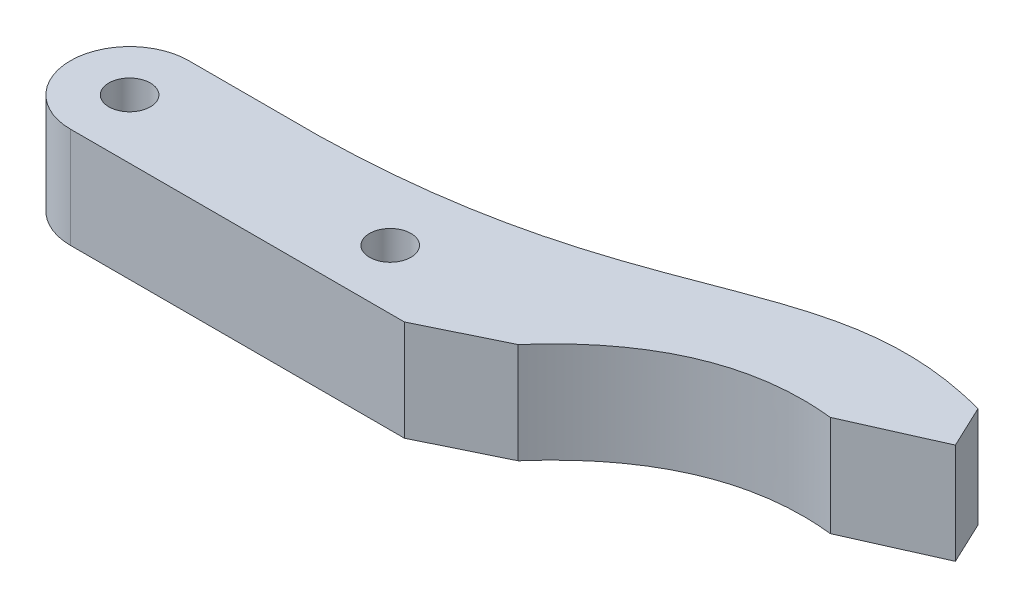
ISO-10303-21;
HEADER;
FILE_DESCRIPTION(('STEP AP214'),'2;1');
FILE_NAME('part.step','',(''),(''),'','','');
FILE_SCHEMA(('AUTOMOTIVE_DESIGN { 1 0 10303 214 1 1 1 1 }'));
ENDSEC;
DATA;
#1=APPLICATION_CONTEXT('core data for automotive mechanical design processes');
#2=APPLICATION_PROTOCOL_DEFINITION('international standard','automotive_design',2000,#1);
#3=PRODUCT_CONTEXT('',#1,'mechanical');
#4=PRODUCT('Part','Part','',(#3));
#5=PRODUCT_RELATED_PRODUCT_CATEGORY('part','',(#4));
#6=PRODUCT_DEFINITION_FORMATION('','',#4);
#7=PRODUCT_DEFINITION_CONTEXT('part definition',#1,'design');
#8=PRODUCT_DEFINITION('design','',#6,#7);
#9=PRODUCT_DEFINITION_SHAPE('','',#8);
#10=(LENGTH_UNIT() NAMED_UNIT(*) SI_UNIT(.MILLI.,.METRE.));
#11=(NAMED_UNIT(*) PLANE_ANGLE_UNIT() SI_UNIT($,.RADIAN.));
#12=(NAMED_UNIT(*) SI_UNIT($,.STERADIAN.) SOLID_ANGLE_UNIT());
#13=UNCERTAINTY_MEASURE_WITH_UNIT(LENGTH_MEASURE(1.E-05),#10,'distance_accuracy_value','');
#14=(GEOMETRIC_REPRESENTATION_CONTEXT(3) GLOBAL_UNCERTAINTY_ASSIGNED_CONTEXT((#13)) GLOBAL_UNIT_ASSIGNED_CONTEXT((#10,
#11,#12)) REPRESENTATION_CONTEXT('',''));
#15=CARTESIAN_POINT('',(0.,0.,0.));
#16=DIRECTION('',(0.,0.,1.));
#17=DIRECTION('',(1.,0.,0.));
#18=AXIS2_PLACEMENT_3D('',#15,#16,#17);
#19=CARTESIAN_POINT('',(0.,8500.,-5000.));
#20=DIRECTION('',(0.,0.,-1.));
#21=DIRECTION('',(-1.,0.,0.));
#22=AXIS2_PLACEMENT_3D('',#19,#20,#21);
#23=PLANE('',#22);
#24=DIRECTION('',(1.,0.,0.));
#25=VECTOR('',#24,1.);
#26=CARTESIAN_POINT('',(0.,8500.,-5000.));
#27=LINE('',#26,#25);
#28=CARTESIAN_POINT('',(0.,8500.,-5000.));
#29=VERTEX_POINT('',#28);
#30=CARTESIAN_POINT('',(11000.,8500.,-5000.));
#31=VERTEX_POINT('',#30);
#32=EDGE_CURVE('E202',#29,#31,#27,.T.);
#33=ORIENTED_EDGE('',*,*,#32,.T.);
#34=DIRECTION('',(0.,1.,0.));
#35=VECTOR('',#34,1.);
#36=CARTESIAN_POINT('',(11000.,0.,-5000.));
#37=LINE('',#36,#35);
#38=CARTESIAN_POINT('',(11000.,0.,-5000.));
#39=VERTEX_POINT('',#38);
#40=EDGE_CURVE('E101',#39,#31,#37,.T.);
#41=ORIENTED_EDGE('',*,*,#40,.F.);
#42=DIRECTION('',(1.,0.,0.));
#43=VECTOR('',#42,1.);
#44=CARTESIAN_POINT('',(0.,0.,-5000.));
#45=LINE('',#44,#43);
#46=CARTESIAN_POINT('',(0.,0.,-5000.));
#47=VERTEX_POINT('',#46);
#48=EDGE_CURVE('E218',#47,#39,#45,.T.);
#49=ORIENTED_EDGE('',*,*,#48,.F.);
#50=DIRECTION('',(0.,-1.,0.));
#51=VECTOR('',#50,1.);
#52=CARTESIAN_POINT('',(0.,8500.,-5000.));
#53=LINE('',#52,#51);
#54=EDGE_CURVE('E51',#29,#47,#53,.T.);
#55=ORIENTED_EDGE('',*,*,#54,.F.);
#56=EDGE_LOOP('',(#33,#41,#49,#55));
#57=FACE_BOUND('',#56,.T.);
#58=ADVANCED_FACE('F41',(#57),#23,.T.);
#59=CARTESIAN_POINT('',(0.,8500.,0.));
#60=DIRECTION('',(0.,-1.,0.));
#61=DIRECTION('',(0.,0.,-1.));
#62=AXIS2_PLACEMENT_3D('',#59,#60,#61);
#63=CYLINDRICAL_SURFACE('',#62,5000.);
#64=CARTESIAN_POINT('',(0.,0.,0.));
#65=DIRECTION('',(0.,1.,0.));
#66=DIRECTION('',(0.,0.,1.));
#67=AXIS2_PLACEMENT_3D('',#64,#65,#66);
#68=CIRCLE('',#67,5000.);
#69=CARTESIAN_POINT('',(0.,0.,5000.));
#70=VERTEX_POINT('',#69);
#71=EDGE_CURVE('E212',#47,#70,#68,.T.);
#72=ORIENTED_EDGE('',*,*,#71,.T.);
#73=DIRECTION('',(0.,-1.,0.));
#74=VECTOR('',#73,1.);
#75=CARTESIAN_POINT('',(0.,8500.,5000.));
#76=LINE('',#75,#74);
#77=CARTESIAN_POINT('',(0.,8500.,5000.));
#78=VERTEX_POINT('',#77);
#79=EDGE_CURVE('E11',#78,#70,#76,.T.);
#80=ORIENTED_EDGE('',*,*,#79,.F.);
#81=CARTESIAN_POINT('',(0.,8500.,0.));
#82=DIRECTION('',(0.,1.,0.));
#83=DIRECTION('',(0.,0.,1.));
#84=AXIS2_PLACEMENT_3D('',#81,#82,#83);
#85=CIRCLE('',#84,5000.);
#86=EDGE_CURVE('E194',#29,#78,#85,.T.);
#87=ORIENTED_EDGE('',*,*,#86,.F.);
#88=ORIENTED_EDGE('',*,*,#54,.T.);
#89=EDGE_LOOP('',(#72,#80,#87,#88));
#90=FACE_BOUND('',#89,.T.);
#91=ADVANCED_FACE('F226',(#90),#63,.T.);
#92=CARTESIAN_POINT('',(0.,8500.,5000.));
#93=DIRECTION('',(0.,0.,-1.));
#94=DIRECTION('',(-1.,0.,0.));
#95=AXIS2_PLACEMENT_3D('',#92,#93,#94);
#96=PLANE('',#95);
#97=DIRECTION('',(1.,0.,0.));
#98=VECTOR('',#97,1.);
#99=CARTESIAN_POINT('',(0.,0.,5000.));
#100=LINE('',#99,#98);
#101=CARTESIAN_POINT('',(28197.4096799473,0.,5000.));
#102=VERTEX_POINT('',#101);
#103=EDGE_CURVE('E70',#70,#102,#100,.T.);
#104=ORIENTED_EDGE('',*,*,#103,.T.);
#105=DIRECTION('',(0.,1.,0.));
#106=VECTOR('',#105,1.);
#107=CARTESIAN_POINT('',(28197.4096799473,0.,5000.));
#108=LINE('',#107,#106);
#109=CARTESIAN_POINT('',(28197.4096799473,8500.,5000.));
#110=VERTEX_POINT('',#109);
#111=EDGE_CURVE('E131',#102,#110,#108,.T.);
#112=ORIENTED_EDGE('',*,*,#111,.T.);
#113=DIRECTION('',(1.,0.,0.));
#114=VECTOR('',#113,1.);
#115=CARTESIAN_POINT('',(0.,8500.,5000.));
#116=LINE('',#115,#114);
#117=EDGE_CURVE('E199',#78,#110,#116,.T.);
#118=ORIENTED_EDGE('',*,*,#117,.F.);
#119=ORIENTED_EDGE('',*,*,#79,.T.);
#120=EDGE_LOOP('',(#104,#112,#118,#119));
#121=FACE_BOUND('',#120,.T.);
#122=ADVANCED_FACE('F238',(#121),#96,.F.);
#123=CARTESIAN_POINT('',(0.,8500.,0.));
#124=DIRECTION('',(0.,-1.,0.));
#125=DIRECTION('',(0.,0.,-1.));
#126=AXIS2_PLACEMENT_3D('',#123,#124,#125);
#127=CYLINDRICAL_SURFACE('',#126,1750.);
#128=CARTESIAN_POINT('',(0.,8500.,0.));
#129=DIRECTION('',(0.,1.,0.));
#130=DIRECTION('',(0.,0.,1.));
#131=AXIS2_PLACEMENT_3D('',#128,#129,#130);
#132=CIRCLE('',#131,1750.);
#133=CARTESIAN_POINT('',(0.,8500.,1750.));
#134=VERTEX_POINT('',#133);
#135=EDGE_CURVE('E190',#134,#134,#132,.T.);
#136=ORIENTED_EDGE('',*,*,#135,.T.);
#137=EDGE_LOOP('',(#136));
#138=FACE_BOUND('',#137,.T.);
#139=CARTESIAN_POINT('',(0.,0.,0.));
#140=DIRECTION('',(0.,1.,0.));
#141=DIRECTION('',(0.,0.,1.));
#142=AXIS2_PLACEMENT_3D('',#139,#140,#141);
#143=CIRCLE('',#142,1750.);
#144=CARTESIAN_POINT('',(0.,0.,1750.));
#145=VERTEX_POINT('',#144);
#146=EDGE_CURVE('E189',#145,#145,#143,.T.);
#147=ORIENTED_EDGE('',*,*,#146,.F.);
#148=EDGE_LOOP('',(#147));
#149=FACE_BOUND('',#148,.T.);
#150=ADVANCED_FACE('F43',(#138,#149),#127,.F.);
#151=CARTESIAN_POINT('',(22000.,8500.,0.));
#152=DIRECTION('',(0.,-1.,0.));
#153=DIRECTION('',(0.,0.,-1.));
#154=AXIS2_PLACEMENT_3D('',#151,#152,#153);
#155=CYLINDRICAL_SURFACE('',#154,1750.);
#156=CARTESIAN_POINT('',(22000.,8500.,0.));
#157=DIRECTION('',(0.,1.,0.));
#158=DIRECTION('',(0.,0.,1.));
#159=AXIS2_PLACEMENT_3D('',#156,#157,#158);
#160=CIRCLE('',#159,1750.);
#161=CARTESIAN_POINT('',(22000.,8500.,1750.));
#162=VERTEX_POINT('',#161);
#163=EDGE_CURVE('E205',#162,#162,#160,.T.);
#164=ORIENTED_EDGE('',*,*,#163,.T.);
#165=EDGE_LOOP('',(#164));
#166=FACE_BOUND('',#165,.T.);
#167=CARTESIAN_POINT('',(22000.,0.,0.));
#168=DIRECTION('',(0.,1.,0.));
#169=DIRECTION('',(0.,0.,1.));
#170=AXIS2_PLACEMENT_3D('',#167,#168,#169);
#171=CIRCLE('',#170,1750.);
#172=CARTESIAN_POINT('',(22000.,0.,1750.));
#173=VERTEX_POINT('',#172);
#174=EDGE_CURVE('E195',#173,#173,#171,.T.);
#175=ORIENTED_EDGE('',*,*,#174,.F.);
#176=EDGE_LOOP('',(#175));
#177=FACE_BOUND('',#176,.T.);
#178=ADVANCED_FACE('F245',(#166,#177),#155,.F.);
#179=CARTESIAN_POINT('',(0.,8500.,0.));
#180=DIRECTION('',(0.,1.,0.));
#181=DIRECTION('',(0.,0.,1.));
#182=AXIS2_PLACEMENT_3D('',#179,#180,#181);
#183=PLANE('',#182);
#184=ORIENTED_EDGE('',*,*,#135,.F.);
#185=EDGE_LOOP('',(#184));
#186=FACE_BOUND('',#185,.T.);
#187=ORIENTED_EDGE('',*,*,#86,.T.);
#188=ORIENTED_EDGE('',*,*,#117,.T.);
#189=DIRECTION('',(0.898794046299166,0.,-0.438371146789079));
#190=VECTOR('',#189,1.);
#191=CARTESIAN_POINT('',(28197.4096799473,8500.,5000.));
#192=LINE('',#191,#190);
#193=CARTESIAN_POINT('',(34649.3568538006,8500.,1853.17510360633));
#194=VERTEX_POINT('',#193);
#195=EDGE_CURVE('E172',#110,#194,#192,.T.);
#196=ORIENTED_EDGE('',*,*,#195,.T.);
#197=CARTESIAN_POINT('',(34649.3568538006,8500.,1853.17510360633));
#198=CARTESIAN_POINT('',(42552.5020029181,8500.,-7200.87132265207));
#199=CARTESIAN_POINT('',(53148.7941696752,8500.,-6000.));
#200=B_SPLINE_CURVE_WITH_KNOTS('',2,(#197,#198,#199),.UNSPECIFIED.,.F.,.F.,(3,3),(0.,1.),.UNSPECIFIED.);
#201=CARTESIAN_POINT('',(53148.7941696752,8500.,-6000.));
#202=VERTEX_POINT('',#201);
#203=EDGE_CURVE('E124',#194,#202,#200,.T.);
#204=ORIENTED_EDGE('',*,*,#203,.T.);
#205=DIRECTION('',(-0.91360510498966,0.,0.406602646495116));
#206=VECTOR('',#205,1.);
#207=CARTESIAN_POINT('',(60457.6350095925,8500.,-9252.82117196093));
#208=LINE('',#207,#206);
#209=CARTESIAN_POINT('',(60457.6350095925,8500.,-9252.82117196093));
#210=VERTEX_POINT('',#209);
#211=EDGE_CURVE('E164',#210,#202,#208,.T.);
#212=ORIENTED_EDGE('',*,*,#211,.F.);
#213=DIRECTION('',(0.42690875239812,0.,0.904294707009767));
#214=VECTOR('',#213,1.);
#215=CARTESIAN_POINT('',(58750.,8500.,-12870.));
#216=LINE('',#215,#214);
#217=CARTESIAN_POINT('',(58750.,8500.,-12870.));
#218=VERTEX_POINT('',#217);
#219=EDGE_CURVE('E158',#218,#210,#216,.T.);
#220=ORIENTED_EDGE('',*,*,#219,.F.);
#221=CARTESIAN_POINT('',(11000.,8500.,-5000.));
#222=CARTESIAN_POINT('',(38094.6691459558,8500.,-5526.94756837382));
#223=CARTESIAN_POINT('',(42172.4965579943,8500.,-17338.2230066185));
#224=CARTESIAN_POINT('',(58750.0000000001,8500.,-12870.));
#225=B_SPLINE_CURVE_WITH_KNOTS('',3,(#221,#222,#223,#224),.UNSPECIFIED.,.F.,.F.,(4,4),(0.,1.),.UNSPECIFIED.);
#226=EDGE_CURVE('E153',#31,#218,#225,.T.);
#227=ORIENTED_EDGE('',*,*,#226,.F.);
#228=ORIENTED_EDGE('',*,*,#32,.F.);
#229=EDGE_LOOP('',(#187,#188,#196,#204,#212,#220,#227,#228));
#230=FACE_BOUND('',#229,.T.);
#231=ORIENTED_EDGE('',*,*,#163,.F.);
#232=EDGE_LOOP('',(#231));
#233=FACE_BOUND('',#232,.T.);
#234=ADVANCED_FACE('F230',(#186,#230,#233),#183,.T.);
#235=CARTESIAN_POINT('',(0.,0.,0.));
#236=DIRECTION('',(0.,1.,0.));
#237=DIRECTION('',(0.,0.,1.));
#238=AXIS2_PLACEMENT_3D('',#235,#236,#237);
#239=PLANE('',#238);
#240=ORIENTED_EDGE('',*,*,#146,.T.);
#241=EDGE_LOOP('',(#240));
#242=FACE_BOUND('',#241,.T.);
#243=ORIENTED_EDGE('',*,*,#71,.F.);
#244=ORIENTED_EDGE('',*,*,#48,.T.);
#245=CARTESIAN_POINT('',(11000.,0.,-5000.));
#246=CARTESIAN_POINT('',(38094.6691459558,0.,-5526.94756837382));
#247=CARTESIAN_POINT('',(42172.4965579943,0.,-17338.2230066185));
#248=CARTESIAN_POINT('',(58750.0000000001,0.,-12870.));
#249=B_SPLINE_CURVE_WITH_KNOTS('',3,(#245,#246,#247,#248),.UNSPECIFIED.,.F.,.F.,(4,4),(0.,1.),.UNSPECIFIED.);
#250=CARTESIAN_POINT('',(58750.,0.,-12870.));
#251=VERTEX_POINT('',#250);
#252=EDGE_CURVE('E78',#39,#251,#249,.T.);
#253=ORIENTED_EDGE('',*,*,#252,.T.);
#254=DIRECTION('',(0.42690875239812,0.,0.904294707009767));
#255=VECTOR('',#254,1.);
#256=CARTESIAN_POINT('',(58750.,0.,-12870.));
#257=LINE('',#256,#255);
#258=CARTESIAN_POINT('',(60457.6350095925,0.,-9252.82117196093));
#259=VERTEX_POINT('',#258);
#260=EDGE_CURVE('E110',#251,#259,#257,.T.);
#261=ORIENTED_EDGE('',*,*,#260,.T.);
#262=DIRECTION('',(-0.91360510498966,0.,0.406602646495116));
#263=VECTOR('',#262,1.);
#264=CARTESIAN_POINT('',(60457.6350095925,0.,-9252.82117196093));
#265=LINE('',#264,#263);
#266=CARTESIAN_POINT('',(53148.7941696752,0.,-6000.));
#267=VERTEX_POINT('',#266);
#268=EDGE_CURVE('E137',#259,#267,#265,.T.);
#269=ORIENTED_EDGE('',*,*,#268,.T.);
#270=CARTESIAN_POINT('',(34649.3568538006,0.,1853.17510360633));
#271=CARTESIAN_POINT('',(42552.5020029181,0.,-7200.87132265207));
#272=CARTESIAN_POINT('',(53148.7941696752,0.,-6000.));
#273=B_SPLINE_CURVE_WITH_KNOTS('',2,(#270,#271,#272),.UNSPECIFIED.,.F.,.F.,(3,3),(0.,1.),.UNSPECIFIED.);
#274=CARTESIAN_POINT('',(34649.3568538006,0.,1853.17510360633));
#275=VERTEX_POINT('',#274);
#276=EDGE_CURVE('E122',#275,#267,#273,.T.);
#277=ORIENTED_EDGE('',*,*,#276,.F.);
#278=DIRECTION('',(0.898794046299166,0.,-0.438371146789079));
#279=VECTOR('',#278,1.);
#280=CARTESIAN_POINT('',(28197.4096799473,0.,5000.));
#281=LINE('',#280,#279);
#282=EDGE_CURVE('E135',#102,#275,#281,.T.);
#283=ORIENTED_EDGE('',*,*,#282,.F.);
#284=ORIENTED_EDGE('',*,*,#103,.F.);
#285=EDGE_LOOP('',(#243,#244,#253,#261,#269,#277,#283,#284));
#286=FACE_BOUND('',#285,.T.);
#287=ORIENTED_EDGE('',*,*,#174,.T.);
#288=EDGE_LOOP('',(#287));
#289=FACE_BOUND('',#288,.T.);
#290=ADVANCED_FACE('F133',(#242,#286,#289),#239,.F.);
#291=DIRECTION('',(0.,1.,0.));
#292=VECTOR('',#291,1.);
#293=SURFACE_OF_LINEAR_EXTRUSION('',#249,#292);
#294=ORIENTED_EDGE('',*,*,#226,.T.);
#295=DIRECTION('',(0.,1.,0.));
#296=VECTOR('',#295,1.);
#297=CARTESIAN_POINT('',(58750.,0.,-12870.));
#298=LINE('',#297,#296);
#299=EDGE_CURVE('E186',#251,#218,#298,.T.);
#300=ORIENTED_EDGE('',*,*,#299,.F.);
#301=ORIENTED_EDGE('',*,*,#252,.F.);
#302=ORIENTED_EDGE('',*,*,#40,.T.);
#303=EDGE_LOOP('',(#294,#300,#301,#302));
#304=FACE_BOUND('',#303,.T.);
#305=ADVANCED_FACE('F233',(#304),#293,.F.);
#306=CARTESIAN_POINT('',(58750.,0.,-12870.));
#307=DIRECTION('',(-0.904294707009767,0.,0.42690875239812));
#308=DIRECTION('',(0.42690875239812,0.,0.904294707009767));
#309=AXIS2_PLACEMENT_3D('',#306,#307,#308);
#310=PLANE('',#309);
#311=ORIENTED_EDGE('',*,*,#219,.T.);
#312=DIRECTION('',(0.,1.,0.));
#313=VECTOR('',#312,1.);
#314=CARTESIAN_POINT('',(60457.6350095925,0.,-9252.82117196093));
#315=LINE('',#314,#313);
#316=EDGE_CURVE('E182',#259,#210,#315,.T.);
#317=ORIENTED_EDGE('',*,*,#316,.F.);
#318=ORIENTED_EDGE('',*,*,#260,.F.);
#319=ORIENTED_EDGE('',*,*,#299,.T.);
#320=EDGE_LOOP('',(#311,#317,#318,#319));
#321=FACE_BOUND('',#320,.T.);
#322=ADVANCED_FACE('F234',(#321),#310,.F.);
#323=CARTESIAN_POINT('',(60457.6350095925,0.,-9252.82117196093));
#324=DIRECTION('',(-0.406602646495116,0.,-0.91360510498966));
#325=DIRECTION('',(-0.91360510498966,0.,0.406602646495116));
#326=AXIS2_PLACEMENT_3D('',#323,#324,#325);
#327=PLANE('',#326);
#328=ORIENTED_EDGE('',*,*,#211,.T.);
#329=DIRECTION('',(0.,1.,0.));
#330=VECTOR('',#329,1.);
#331=CARTESIAN_POINT('',(53148.7941696752,0.,-6000.));
#332=LINE('',#331,#330);
#333=EDGE_CURVE('E130',#267,#202,#332,.T.);
#334=ORIENTED_EDGE('',*,*,#333,.F.);
#335=ORIENTED_EDGE('',*,*,#268,.F.);
#336=ORIENTED_EDGE('',*,*,#316,.T.);
#337=EDGE_LOOP('',(#328,#334,#335,#336));
#338=FACE_BOUND('',#337,.T.);
#339=ADVANCED_FACE('F236',(#338),#327,.F.);
#340=DIRECTION('',(0.,1.,0.));
#341=VECTOR('',#340,1.);
#342=SURFACE_OF_LINEAR_EXTRUSION('',#273,#341);
#343=ORIENTED_EDGE('',*,*,#203,.F.);
#344=DIRECTION('',(0.,1.,0.));
#345=VECTOR('',#344,1.);
#346=CARTESIAN_POINT('',(34649.3568538006,0.,1853.17510360633));
#347=LINE('',#346,#345);
#348=EDGE_CURVE('E119',#275,#194,#347,.T.);
#349=ORIENTED_EDGE('',*,*,#348,.F.);
#350=ORIENTED_EDGE('',*,*,#276,.T.);
#351=ORIENTED_EDGE('',*,*,#333,.T.);
#352=EDGE_LOOP('',(#343,#349,#350,#351));
#353=FACE_BOUND('',#352,.T.);
#354=ADVANCED_FACE('F121',(#353),#342,.T.);
#355=CARTESIAN_POINT('',(28197.4096799473,0.,5000.));
#356=DIRECTION('',(0.438371146789079,0.,0.898794046299166));
#357=DIRECTION('',(0.898794046299166,0.,-0.438371146789079));
#358=AXIS2_PLACEMENT_3D('',#355,#356,#357);
#359=PLANE('',#358);
#360=ORIENTED_EDGE('',*,*,#195,.F.);
#361=ORIENTED_EDGE('',*,*,#111,.F.);
#362=ORIENTED_EDGE('',*,*,#282,.T.);
#363=ORIENTED_EDGE('',*,*,#348,.T.);
#364=EDGE_LOOP('',(#360,#361,#362,#363));
#365=FACE_BOUND('',#364,.T.);
#366=ADVANCED_FACE('F142',(#365),#359,.T.);
#367=CLOSED_SHELL('',(#58,#91,#122,#150,#178,#234,#290,#305,#322,#339,#354,#366));
#368=MANIFOLD_SOLID_BREP('B2',#367);
#369=ADVANCED_BREP_SHAPE_REPRESENTATION('',(#18,#368),#14);
#370=SHAPE_DEFINITION_REPRESENTATION(#9,#369);
ENDSEC;
END-ISO-10303-21;
